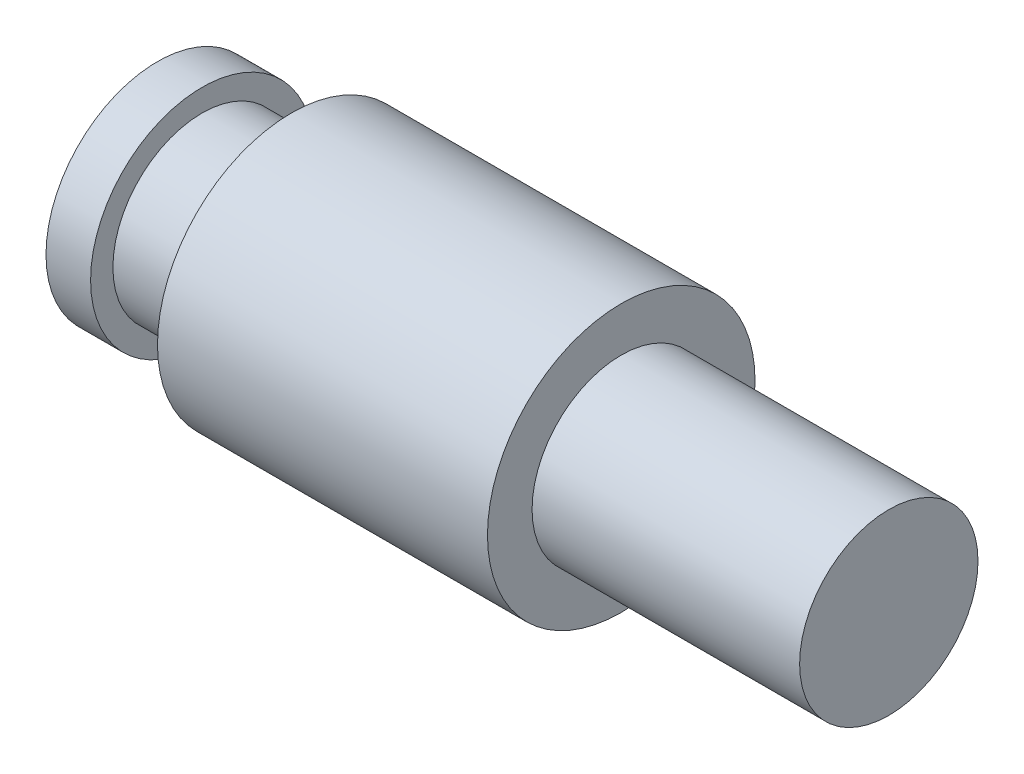
ISO-10303-21;
HEADER;
FILE_DESCRIPTION(('STEP AP214'),'2;1');
FILE_NAME('part.step','',(''),(''),'','','');
FILE_SCHEMA(('AUTOMOTIVE_DESIGN { 1 0 10303 214 1 1 1 1 }'));
ENDSEC;
DATA;
#1=APPLICATION_CONTEXT('core data for automotive mechanical design processes');
#2=APPLICATION_PROTOCOL_DEFINITION('international standard','automotive_design',2000,#1);
#3=PRODUCT_CONTEXT('',#1,'mechanical');
#4=PRODUCT('Part','Part','',(#3));
#5=PRODUCT_RELATED_PRODUCT_CATEGORY('part','',(#4));
#6=PRODUCT_DEFINITION_FORMATION('','',#4);
#7=PRODUCT_DEFINITION_CONTEXT('part definition',#1,'design');
#8=PRODUCT_DEFINITION('design','',#6,#7);
#9=PRODUCT_DEFINITION_SHAPE('','',#8);
#10=(LENGTH_UNIT() NAMED_UNIT(*) SI_UNIT(.MILLI.,.METRE.));
#11=(NAMED_UNIT(*) PLANE_ANGLE_UNIT() SI_UNIT($,.RADIAN.));
#12=(NAMED_UNIT(*) SI_UNIT($,.STERADIAN.) SOLID_ANGLE_UNIT());
#13=UNCERTAINTY_MEASURE_WITH_UNIT(LENGTH_MEASURE(1.E-05),#10,'distance_accuracy_value','');
#14=(GEOMETRIC_REPRESENTATION_CONTEXT(3) GLOBAL_UNCERTAINTY_ASSIGNED_CONTEXT((#13)) GLOBAL_UNIT_ASSIGNED_CONTEXT((#10,
#11,#12)) REPRESENTATION_CONTEXT('',''));
#15=CARTESIAN_POINT('',(0.,0.,0.));
#16=DIRECTION('',(0.,0.,1.));
#17=DIRECTION('',(1.,0.,0.));
#18=AXIS2_PLACEMENT_3D('',#15,#16,#17);
#19=CARTESIAN_POINT('',(0.,0.,0.));
#20=DIRECTION('',(-1.,0.,0.));
#21=DIRECTION('',(0.,0.,1.));
#22=AXIS2_PLACEMENT_3D('',#19,#20,#21);
#23=PLANE('',#22);
#24=CARTESIAN_POINT('',(0.,0.,0.));
#25=DIRECTION('',(1.,0.,0.));
#26=DIRECTION('',(0.,0.,-1.));
#27=AXIS2_PLACEMENT_3D('',#24,#25,#26);
#28=CIRCLE('',#27,2.5);
#29=CARTESIAN_POINT('',(0.,0.,-2.5));
#30=VERTEX_POINT('',#29);
#31=EDGE_CURVE('E10',#30,#30,#28,.T.);
#32=ORIENTED_EDGE('',*,*,#31,.F.);
#33=EDGE_LOOP('',(#32));
#34=FACE_BOUND('',#33,.T.);
#35=ADVANCED_FACE('F36',(#34),#23,.T.);
#36=CARTESIAN_POINT('',(16.4,0.,0.));
#37=DIRECTION('',(1.,0.,0.));
#38=DIRECTION('',(0.,0.,-1.));
#39=AXIS2_PLACEMENT_3D('',#36,#37,#38);
#40=CYLINDRICAL_SURFACE('',#39,2.5);
#41=ORIENTED_EDGE('',*,*,#31,.T.);
#42=EDGE_LOOP('',(#41));
#43=FACE_BOUND('',#42,.T.);
#44=CARTESIAN_POINT('',(1.,0.,0.));
#45=DIRECTION('',(1.,0.,0.));
#46=DIRECTION('',(0.,0.,-1.));
#47=AXIS2_PLACEMENT_3D('',#44,#45,#46);
#48=CIRCLE('',#47,2.5);
#49=CARTESIAN_POINT('',(1.,0.,-2.5));
#50=VERTEX_POINT('',#49);
#51=EDGE_CURVE('E42',#50,#50,#48,.T.);
#52=ORIENTED_EDGE('',*,*,#51,.F.);
#53=EDGE_LOOP('',(#52));
#54=FACE_BOUND('',#53,.T.);
#55=ADVANCED_FACE('F85',(#43,#54),#40,.T.);
#56=CARTESIAN_POINT('',(1.,2.5,0.));
#57=DIRECTION('',(1.,0.,0.));
#58=DIRECTION('',(0.,0.,-1.));
#59=AXIS2_PLACEMENT_3D('',#56,#57,#58);
#60=PLANE('',#59);
#61=ORIENTED_EDGE('',*,*,#51,.T.);
#62=EDGE_LOOP('',(#61));
#63=FACE_BOUND('',#62,.T.);
#64=CARTESIAN_POINT('',(1.,0.,0.));
#65=DIRECTION('',(1.,0.,0.));
#66=DIRECTION('',(0.,0.,-1.));
#67=AXIS2_PLACEMENT_3D('',#64,#65,#66);
#68=CIRCLE('',#67,2.);
#69=CARTESIAN_POINT('',(1.,0.,-2.));
#70=VERTEX_POINT('',#69);
#71=EDGE_CURVE('E46',#70,#70,#68,.T.);
#72=ORIENTED_EDGE('',*,*,#71,.F.);
#73=EDGE_LOOP('',(#72));
#74=FACE_BOUND('',#73,.T.);
#75=ADVANCED_FACE('F89',(#63,#74),#60,.T.);
#76=CARTESIAN_POINT('',(16.4,0.,0.));
#77=DIRECTION('',(1.,0.,0.));
#78=DIRECTION('',(0.,0.,-1.));
#79=AXIS2_PLACEMENT_3D('',#76,#77,#78);
#80=CYLINDRICAL_SURFACE('',#79,2.);
#81=ORIENTED_EDGE('',*,*,#71,.T.);
#82=EDGE_LOOP('',(#81));
#83=FACE_BOUND('',#82,.T.);
#84=CARTESIAN_POINT('',(3.,0.,0.));
#85=DIRECTION('',(1.,0.,0.));
#86=DIRECTION('',(0.,0.,-1.));
#87=AXIS2_PLACEMENT_3D('',#84,#85,#86);
#88=CIRCLE('',#87,2.);
#89=CARTESIAN_POINT('',(3.,0.,-2.));
#90=VERTEX_POINT('',#89);
#91=EDGE_CURVE('E50',#90,#90,#88,.T.);
#92=ORIENTED_EDGE('',*,*,#91,.F.);
#93=EDGE_LOOP('',(#92));
#94=FACE_BOUND('',#93,.T.);
#95=ADVANCED_FACE('F93',(#83,#94),#80,.T.);
#96=CARTESIAN_POINT('',(3.,2.,0.));
#97=DIRECTION('',(-1.,0.,0.));
#98=DIRECTION('',(0.,0.,1.));
#99=AXIS2_PLACEMENT_3D('',#96,#97,#98);
#100=PLANE('',#99);
#101=ORIENTED_EDGE('',*,*,#91,.T.);
#102=EDGE_LOOP('',(#101));
#103=FACE_BOUND('',#102,.T.);
#104=CARTESIAN_POINT('',(3.,0.,0.));
#105=DIRECTION('',(1.,0.,0.));
#106=DIRECTION('',(0.,0.,-1.));
#107=AXIS2_PLACEMENT_3D('',#104,#105,#106);
#108=CIRCLE('',#107,3.);
#109=CARTESIAN_POINT('',(3.,0.,-3.));
#110=VERTEX_POINT('',#109);
#111=EDGE_CURVE('E55',#110,#110,#108,.T.);
#112=ORIENTED_EDGE('',*,*,#111,.F.);
#113=EDGE_LOOP('',(#112));
#114=FACE_BOUND('',#113,.T.);
#115=ADVANCED_FACE('F99',(#103,#114),#100,.T.);
#116=CARTESIAN_POINT('',(16.4,0.,0.));
#117=DIRECTION('',(1.,0.,0.));
#118=DIRECTION('',(0.,0.,-1.));
#119=AXIS2_PLACEMENT_3D('',#116,#117,#118);
#120=CYLINDRICAL_SURFACE('',#119,3.);
#121=ORIENTED_EDGE('',*,*,#111,.T.);
#122=EDGE_LOOP('',(#121));
#123=FACE_BOUND('',#122,.T.);
#124=CARTESIAN_POINT('',(10.4,0.,0.));
#125=DIRECTION('',(1.,0.,0.));
#126=DIRECTION('',(0.,0.,-1.));
#127=AXIS2_PLACEMENT_3D('',#124,#125,#126);
#128=CIRCLE('',#127,3.);
#129=CARTESIAN_POINT('',(10.4,0.,-3.));
#130=VERTEX_POINT('',#129);
#131=EDGE_CURVE('E58',#130,#130,#128,.T.);
#132=ORIENTED_EDGE('',*,*,#131,.F.);
#133=EDGE_LOOP('',(#132));
#134=FACE_BOUND('',#133,.T.);
#135=ADVANCED_FACE('F81',(#123,#134),#120,.T.);
#136=CARTESIAN_POINT('',(10.4,3.,0.));
#137=DIRECTION('',(1.,0.,0.));
#138=DIRECTION('',(0.,0.,-1.));
#139=AXIS2_PLACEMENT_3D('',#136,#137,#138);
#140=PLANE('',#139);
#141=ORIENTED_EDGE('',*,*,#131,.T.);
#142=EDGE_LOOP('',(#141));
#143=FACE_BOUND('',#142,.T.);
#144=CARTESIAN_POINT('',(10.4,0.,0.));
#145=DIRECTION('',(1.,0.,0.));
#146=DIRECTION('',(0.,0.,-1.));
#147=AXIS2_PLACEMENT_3D('',#144,#145,#146);
#148=CIRCLE('',#147,2.);
#149=CARTESIAN_POINT('',(10.4,0.,-2.));
#150=VERTEX_POINT('',#149);
#151=EDGE_CURVE('E62',#150,#150,#148,.T.);
#152=ORIENTED_EDGE('',*,*,#151,.F.);
#153=EDGE_LOOP('',(#152));
#154=FACE_BOUND('',#153,.T.);
#155=ADVANCED_FACE('F73',(#143,#154),#140,.T.);
#156=CARTESIAN_POINT('',(16.4,0.,0.));
#157=DIRECTION('',(1.,0.,0.));
#158=DIRECTION('',(0.,0.,-1.));
#159=AXIS2_PLACEMENT_3D('',#156,#157,#158);
#160=CYLINDRICAL_SURFACE('',#159,2.);
#161=ORIENTED_EDGE('',*,*,#151,.T.);
#162=EDGE_LOOP('',(#161));
#163=FACE_BOUND('',#162,.T.);
#164=CARTESIAN_POINT('',(16.4,0.,0.));
#165=DIRECTION('',(1.,0.,0.));
#166=DIRECTION('',(0.,0.,-1.));
#167=AXIS2_PLACEMENT_3D('',#164,#165,#166);
#168=CIRCLE('',#167,2.);
#169=CARTESIAN_POINT('',(16.4,0.,-2.));
#170=VERTEX_POINT('',#169);
#171=EDGE_CURVE('E65',#170,#170,#168,.T.);
#172=ORIENTED_EDGE('',*,*,#171,.F.);
#173=EDGE_LOOP('',(#172));
#174=FACE_BOUND('',#173,.T.);
#175=ADVANCED_FACE('F71',(#163,#174),#160,.T.);
#176=CARTESIAN_POINT('',(16.4,2.,0.));
#177=DIRECTION('',(1.,0.,0.));
#178=DIRECTION('',(0.,0.,-1.));
#179=AXIS2_PLACEMENT_3D('',#176,#177,#178);
#180=PLANE('',#179);
#181=ORIENTED_EDGE('',*,*,#171,.T.);
#182=EDGE_LOOP('',(#181));
#183=FACE_BOUND('',#182,.T.);
#184=ADVANCED_FACE('F69',(#183),#180,.T.);
#185=CLOSED_SHELL('',(#35,#55,#75,#95,#115,#135,#155,#175,#184));
#186=MANIFOLD_SOLID_BREP('B2',#185);
#187=ADVANCED_BREP_SHAPE_REPRESENTATION('',(#18,#186),#14);
#188=SHAPE_DEFINITION_REPRESENTATION(#9,#187);
ENDSEC;
END-ISO-10303-21;
